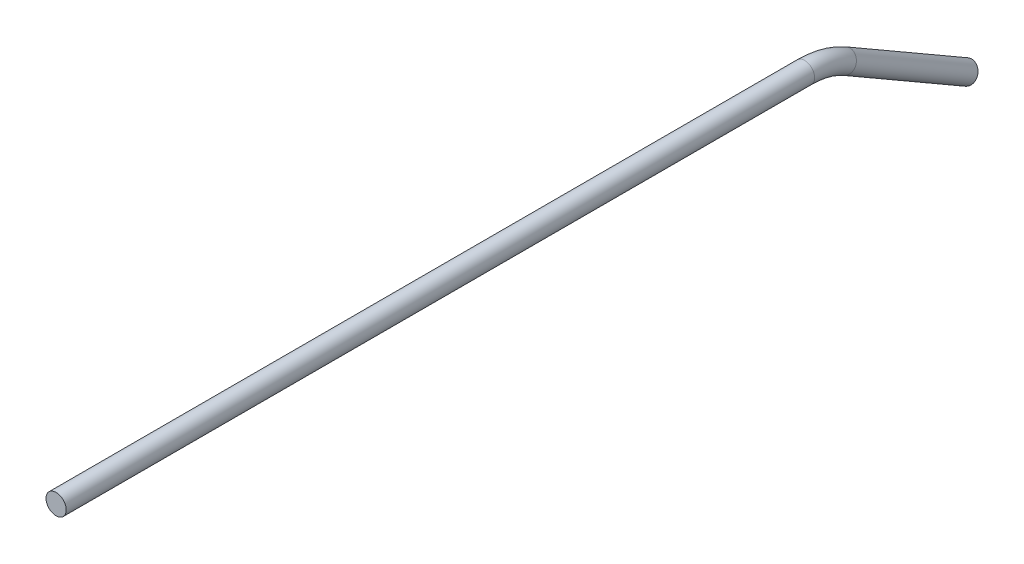
ISO-10303-21;
HEADER;
FILE_DESCRIPTION(('STEP AP214'),'2;1');
FILE_NAME('part.step','',(''),(''),'','','');
FILE_SCHEMA(('AUTOMOTIVE_DESIGN { 1 0 10303 214 1 1 1 1 }'));
ENDSEC;
DATA;
#1=APPLICATION_CONTEXT('core data for automotive mechanical design processes');
#2=APPLICATION_PROTOCOL_DEFINITION('international standard','automotive_design',2000,#1);
#3=PRODUCT_CONTEXT('',#1,'mechanical');
#4=PRODUCT('Part','Part','',(#3));
#5=PRODUCT_RELATED_PRODUCT_CATEGORY('part','',(#4));
#6=PRODUCT_DEFINITION_FORMATION('','',#4);
#7=PRODUCT_DEFINITION_CONTEXT('part definition',#1,'design');
#8=PRODUCT_DEFINITION('design','',#6,#7);
#9=PRODUCT_DEFINITION_SHAPE('','',#8);
#10=(LENGTH_UNIT() NAMED_UNIT(*) SI_UNIT(.MILLI.,.METRE.));
#11=(NAMED_UNIT(*) PLANE_ANGLE_UNIT() SI_UNIT($,.RADIAN.));
#12=(NAMED_UNIT(*) SI_UNIT($,.STERADIAN.) SOLID_ANGLE_UNIT());
#13=UNCERTAINTY_MEASURE_WITH_UNIT(LENGTH_MEASURE(1.E-05),#10,'distance_accuracy_value','');
#14=(GEOMETRIC_REPRESENTATION_CONTEXT(3) GLOBAL_UNCERTAINTY_ASSIGNED_CONTEXT((#13)) GLOBAL_UNIT_ASSIGNED_CONTEXT((#10,
#11,#12)) REPRESENTATION_CONTEXT('',''));
#15=CARTESIAN_POINT('',(0.,0.,0.));
#16=DIRECTION('',(0.,0.,1.));
#17=DIRECTION('',(1.,0.,0.));
#18=AXIS2_PLACEMENT_3D('',#15,#16,#17);
#19=CARTESIAN_POINT('',(0.,-3.40295474387527,-247.194090512249));
#20=DIRECTION('',(0.,-0.500000000000001,-0.866025403784438));
#21=DIRECTION('',(0.,0.866025403784438,-0.500000000000001));
#22=AXIS2_PLACEMENT_3D('',#19,#20,#21);
#23=CYLINDRICAL_SURFACE('',#22,3.175);
#24=CARTESIAN_POINT('',(0.,-3.40295474387527,-247.194090512249));
#25=DIRECTION('',(0.,0.500000000000001,0.866025403784438));
#26=DIRECTION('',(1.,0.,0.));
#27=AXIS2_PLACEMENT_3D('',#24,#25,#26);
#28=CIRCLE('',#27,3.175);
#29=CARTESIAN_POINT('',(0.,-0.653324086859676,-248.781590512249));
#30=VERTEX_POINT('',#29);
#31=EDGE_CURVE('E37',#30,#30,#28,.T.);
#32=ORIENTED_EDGE('',*,*,#31,.F.);
#33=EDGE_LOOP('',(#32));
#34=FACE_BOUND('',#33,.T.);
#35=CARTESIAN_POINT('',(0.,-25.4,-285.294090512249));
#36=DIRECTION('',(0.,0.500000000000001,0.866025403784438));
#37=DIRECTION('',(1.,0.,0.));
#38=AXIS2_PLACEMENT_3D('',#35,#36,#37);
#39=CIRCLE('',#38,3.175);
#40=CARTESIAN_POINT('',(3.175,-25.4,-285.294090512249));
#41=VERTEX_POINT('',#40);
#42=EDGE_CURVE('E10',#41,#41,#39,.T.);
#43=ORIENTED_EDGE('',*,*,#42,.T.);
#44=EDGE_LOOP('',(#43));
#45=FACE_BOUND('',#44,.T.);
#46=ADVANCED_FACE('F31',(#34,#45),#23,.T.);
#47=CARTESIAN_POINT('',(0.,-25.4,-234.494090512249));
#48=DIRECTION('',(-1.,0.,0.));
#49=DIRECTION('',(0.,0.,1.));
#50=AXIS2_PLACEMENT_3D('',#47,#48,#49);
#51=TOROIDAL_SURFACE('',#50,25.4,3.175);
#52=CARTESIAN_POINT('',(0.,0.,-234.494090512249));
#53=DIRECTION('',(0.,0.,1.));
#54=DIRECTION('',(1.,0.,0.));
#55=AXIS2_PLACEMENT_3D('',#52,#53,#54);
#56=CIRCLE('',#55,3.175);
#57=CARTESIAN_POINT('',(0.,3.175,-234.494090512249));
#58=VERTEX_POINT('',#57);
#59=EDGE_CURVE('E41',#58,#58,#56,.T.);
#60=CARTESIAN_POINT('',(0.,-25.4,-234.494090512249));
#61=DIRECTION('',(-1.,0.,0.));
#62=DIRECTION('',(0.,0.,1.));
#63=AXIS2_PLACEMENT_3D('',#60,#61,#62);
#64=CIRCLE('',#63,28.575);
#65=EDGE_CURVE('',#58,#30,#64,.T.);
#66=ORIENTED_EDGE('',*,*,#59,.F.);
#67=ORIENTED_EDGE('',*,*,#31,.T.);
#68=ORIENTED_EDGE('',*,*,#65,.T.);
#69=ORIENTED_EDGE('',*,*,#65,.F.);
#70=EDGE_LOOP('',(#66,#68,#67,#69));
#71=FACE_BOUND('',#70,.T.);
#72=ADVANCED_FACE('F56',(#71),#51,.T.);
#73=CARTESIAN_POINT('',(0.,0.,-234.494090512249));
#74=DIRECTION('',(0.,0.,1.));
#75=DIRECTION('',(1.,0.,0.));
#76=AXIS2_PLACEMENT_3D('',#73,#74,#75);
#77=CYLINDRICAL_SURFACE('',#76,3.175);
#78=ORIENTED_EDGE('',*,*,#59,.T.);
#79=EDGE_LOOP('',(#78));
#80=FACE_BOUND('',#79,.T.);
#81=CARTESIAN_POINT('',(0.,0.,0.));
#82=DIRECTION('',(0.,0.,1.));
#83=DIRECTION('',(1.,0.,0.));
#84=AXIS2_PLACEMENT_3D('',#81,#82,#83);
#85=CIRCLE('',#84,3.175);
#86=CARTESIAN_POINT('',(3.175,0.,0.));
#87=VERTEX_POINT('',#86);
#88=EDGE_CURVE('E45',#87,#87,#85,.T.);
#89=ORIENTED_EDGE('',*,*,#88,.F.);
#90=EDGE_LOOP('',(#89));
#91=FACE_BOUND('',#90,.T.);
#92=ADVANCED_FACE('F53',(#80,#91),#77,.T.);
#93=CARTESIAN_POINT('',(0.,-25.4,-285.294090512249));
#94=DIRECTION('',(0.,0.500000000000001,0.866025403784438));
#95=DIRECTION('',(1.,0.,0.));
#96=AXIS2_PLACEMENT_3D('',#93,#94,#95);
#97=PLANE('',#96);
#98=ORIENTED_EDGE('',*,*,#42,.F.);
#99=EDGE_LOOP('',(#98));
#100=FACE_BOUND('',#99,.T.);
#101=ADVANCED_FACE('F55',(#100),#97,.F.);
#102=CARTESIAN_POINT('',(0.,0.,0.));
#103=DIRECTION('',(0.,0.,1.));
#104=DIRECTION('',(1.,0.,0.));
#105=AXIS2_PLACEMENT_3D('',#102,#103,#104);
#106=PLANE('',#105);
#107=ORIENTED_EDGE('',*,*,#88,.T.);
#108=EDGE_LOOP('',(#107));
#109=FACE_BOUND('',#108,.T.);
#110=ADVANCED_FACE('F51',(#109),#106,.T.);
#111=CLOSED_SHELL('',(#46,#72,#92,#101,#110));
#112=MANIFOLD_SOLID_BREP('B2',#111);
#113=ADVANCED_BREP_SHAPE_REPRESENTATION('',(#18,#112),#14);
#114=SHAPE_DEFINITION_REPRESENTATION(#9,#113);
ENDSEC;
END-ISO-10303-21;
